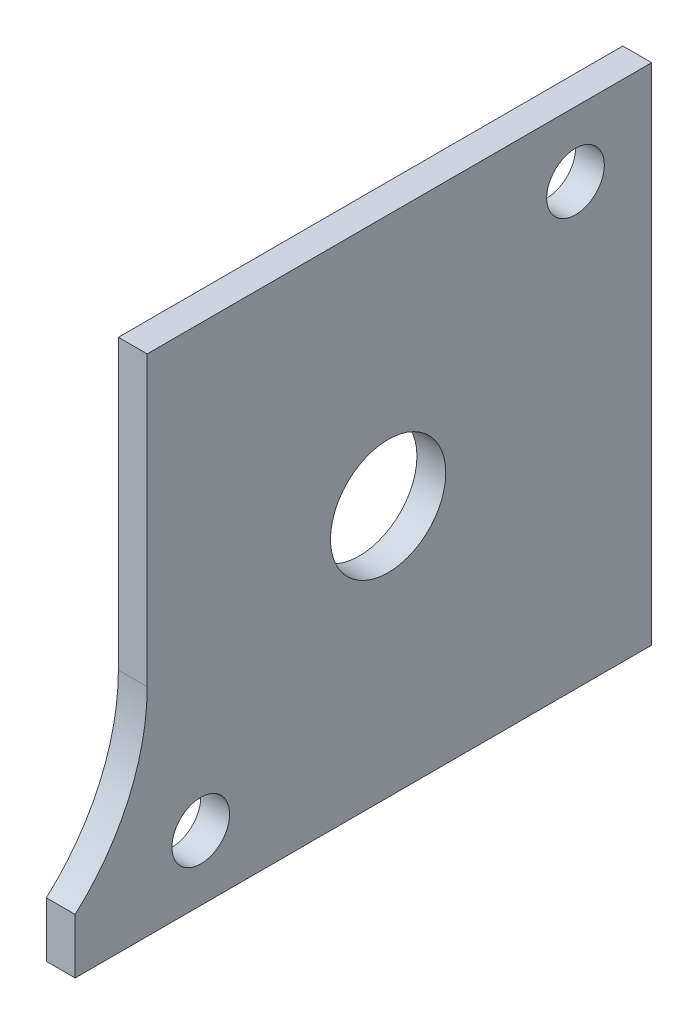
ISO-10303-21;
HEADER;
FILE_DESCRIPTION(('STEP AP214'),'2;1');
FILE_NAME('part.step','',(''),(''),'','','');
FILE_SCHEMA(('AUTOMOTIVE_DESIGN { 1 0 10303 214 1 1 1 1 }'));
ENDSEC;
DATA;
#1=APPLICATION_CONTEXT('core data for automotive mechanical design processes');
#2=APPLICATION_PROTOCOL_DEFINITION('international standard','automotive_design',2000,#1);
#3=PRODUCT_CONTEXT('',#1,'mechanical');
#4=PRODUCT('Part','Part','',(#3));
#5=PRODUCT_RELATED_PRODUCT_CATEGORY('part','',(#4));
#6=PRODUCT_DEFINITION_FORMATION('','',#4);
#7=PRODUCT_DEFINITION_CONTEXT('part definition',#1,'design');
#8=PRODUCT_DEFINITION('design','',#6,#7);
#9=PRODUCT_DEFINITION_SHAPE('','',#8);
#10=(LENGTH_UNIT() NAMED_UNIT(*) SI_UNIT(.MILLI.,.METRE.));
#11=(NAMED_UNIT(*) PLANE_ANGLE_UNIT() SI_UNIT($,.RADIAN.));
#12=(NAMED_UNIT(*) SI_UNIT($,.STERADIAN.) SOLID_ANGLE_UNIT());
#13=UNCERTAINTY_MEASURE_WITH_UNIT(LENGTH_MEASURE(1.E-05),#10,'distance_accuracy_value','');
#14=(GEOMETRIC_REPRESENTATION_CONTEXT(3) GLOBAL_UNCERTAINTY_ASSIGNED_CONTEXT((#13)) GLOBAL_UNIT_ASSIGNED_CONTEXT((#10,
#11,#12)) REPRESENTATION_CONTEXT('',''));
#15=CARTESIAN_POINT('',(0.,0.,0.));
#16=DIRECTION('',(0.,0.,1.));
#17=DIRECTION('',(1.,0.,0.));
#18=AXIS2_PLACEMENT_3D('',#15,#16,#17);
#19=CARTESIAN_POINT('',(2.,-25.9929967703973,-71.2969210397363));
#20=DIRECTION('',(1.,0.,0.));
#21=DIRECTION('',(0.,0.,-1.));
#22=AXIS2_PLACEMENT_3D('',#19,#20,#21);
#23=PLANE('',#22);
#24=CARTESIAN_POINT('',(2.,-36.4929967703972,-90.0114004130906));
#25=DIRECTION('',(1.,0.,0.));
#26=DIRECTION('',(0.,0.,-1.));
#27=AXIS2_PLACEMENT_3D('',#24,#25,#26);
#28=CIRCLE('',#27,2.);
#29=CARTESIAN_POINT('',(2.,-36.4929967703972,-92.0114004130906));
#30=VERTEX_POINT('',#29);
#31=EDGE_CURVE('E182',#30,#30,#28,.T.);
#32=ORIENTED_EDGE('',*,*,#31,.F.);
#33=EDGE_LOOP('',(#32));
#34=FACE_BOUND('',#33,.T.);
#35=DIRECTION('',(0.,0.,1.));
#36=VECTOR('',#35,1.);
#37=CARTESIAN_POINT('',(2.,-5.99299677039726,-121.296921039736));
#38=LINE('',#37,#36);
#39=CARTESIAN_POINT('',(2.,-5.99299677039726,-121.296921039736));
#40=VERTEX_POINT('',#39);
#41=CARTESIAN_POINT('',(2.,-5.99299677039726,-86.2969210397363));
#42=VERTEX_POINT('',#41);
#43=EDGE_CURVE('E126',#40,#42,#38,.T.);
#44=ORIENTED_EDGE('',*,*,#43,.T.);
#45=DIRECTION('',(0.,-1.,0.));
#46=VECTOR('',#45,1.);
#47=CARTESIAN_POINT('',(2.,-25.9929967703973,-86.2969210397363));
#48=LINE('',#47,#46);
#49=CARTESIAN_POINT('',(2.,-25.9929967703973,-86.2969210397363));
#50=VERTEX_POINT('',#49);
#51=EDGE_CURVE('E84',#42,#50,#48,.T.);
#52=ORIENTED_EDGE('',*,*,#51,.T.);
#53=CARTESIAN_POINT('',(2.,-25.9929967703973,-71.2969210397363));
#54=DIRECTION('',(-1.,0.,0.));
#55=DIRECTION('',(0.,0.,-1.));
#56=AXIS2_PLACEMENT_3D('',#53,#54,#55);
#57=CIRCLE('',#56,15.);
#58=CARTESIAN_POINT('',(2.,-37.1733366578962,-81.2969210397363));
#59=VERTEX_POINT('',#58);
#60=EDGE_CURVE('E97',#50,#59,#57,.T.);
#61=ORIENTED_EDGE('',*,*,#60,.T.);
#62=DIRECTION('',(0.,-1.,0.));
#63=VECTOR('',#62,1.);
#64=CARTESIAN_POINT('',(2.,-40.9929967703973,-81.2969210397363));
#65=LINE('',#64,#63);
#66=CARTESIAN_POINT('',(2.,-40.9929967703973,-81.2969210397363));
#67=VERTEX_POINT('',#66);
#68=EDGE_CURVE('E91',#59,#67,#65,.T.);
#69=ORIENTED_EDGE('',*,*,#68,.T.);
#70=DIRECTION('',(0.,0.,-1.));
#71=VECTOR('',#70,1.);
#72=CARTESIAN_POINT('',(2.,-40.9929967703973,-121.296921039736));
#73=LINE('',#72,#71);
#74=CARTESIAN_POINT('',(2.,-40.9929967703973,-121.296921039736));
#75=VERTEX_POINT('',#74);
#76=EDGE_CURVE('E95',#67,#75,#73,.T.);
#77=ORIENTED_EDGE('',*,*,#76,.T.);
#78=DIRECTION('',(0.,1.,0.));
#79=VECTOR('',#78,1.);
#80=CARTESIAN_POINT('',(2.,-40.9929967703973,-121.296921039736));
#81=LINE('',#80,#79);
#82=EDGE_CURVE('E47',#75,#40,#81,.T.);
#83=ORIENTED_EDGE('',*,*,#82,.T.);
#84=EDGE_LOOP('',(#44,#52,#61,#69,#77,#83));
#85=FACE_BOUND('',#84,.T.);
#86=CARTESIAN_POINT('',(2.,-10.4929967703972,-116.011400413091));
#87=DIRECTION('',(1.,0.,0.));
#88=DIRECTION('',(0.,0.,-1.));
#89=AXIS2_PLACEMENT_3D('',#86,#87,#88);
#90=CIRCLE('',#89,2.);
#91=CARTESIAN_POINT('',(2.,-10.4929967703972,-118.011400413091));
#92=VERTEX_POINT('',#91);
#93=EDGE_CURVE('E119',#92,#92,#90,.T.);
#94=ORIENTED_EDGE('',*,*,#93,.F.);
#95=EDGE_LOOP('',(#94));
#96=FACE_BOUND('',#95,.T.);
#97=CARTESIAN_POINT('',(2.,-23.4929967703972,-103.011400413091));
#98=DIRECTION('',(1.,0.,0.));
#99=DIRECTION('',(0.,0.,-1.));
#100=AXIS2_PLACEMENT_3D('',#97,#98,#99);
#101=CIRCLE('',#100,4.00000000000001);
#102=CARTESIAN_POINT('',(2.,-23.4929967703972,-107.011400413091));
#103=VERTEX_POINT('',#102);
#104=EDGE_CURVE('E173',#103,#103,#101,.T.);
#105=ORIENTED_EDGE('',*,*,#104,.F.);
#106=EDGE_LOOP('',(#105));
#107=FACE_BOUND('',#106,.T.);
#108=ADVANCED_FACE('F30',(#34,#85,#96,#107),#23,.T.);
#109=CARTESIAN_POINT('',(0.,-25.9929967703973,-71.2969210397363));
#110=DIRECTION('',(1.,0.,0.));
#111=DIRECTION('',(0.,0.,-1.));
#112=AXIS2_PLACEMENT_3D('',#109,#110,#111);
#113=PLANE('',#112);
#114=CARTESIAN_POINT('',(0.,-36.4929967703972,-90.0114004130906));
#115=DIRECTION('',(1.,0.,0.));
#116=DIRECTION('',(0.,0.,-1.));
#117=AXIS2_PLACEMENT_3D('',#114,#115,#116);
#118=CIRCLE('',#117,2.);
#119=CARTESIAN_POINT('',(0.,-36.4929967703972,-92.0114004130906));
#120=VERTEX_POINT('',#119);
#121=EDGE_CURVE('E179',#120,#120,#118,.T.);
#122=ORIENTED_EDGE('',*,*,#121,.T.);
#123=EDGE_LOOP('',(#122));
#124=FACE_BOUND('',#123,.T.);
#125=DIRECTION('',(0.,0.,1.));
#126=VECTOR('',#125,1.);
#127=CARTESIAN_POINT('',(0.,-5.99299677039726,-121.296921039736));
#128=LINE('',#127,#126);
#129=CARTESIAN_POINT('',(0.,-5.99299677039726,-121.296921039736));
#130=VERTEX_POINT('',#129);
#131=CARTESIAN_POINT('',(0.,-5.99299677039726,-86.2969210397363));
#132=VERTEX_POINT('',#131);
#133=EDGE_CURVE('E115',#130,#132,#128,.T.);
#134=ORIENTED_EDGE('',*,*,#133,.F.);
#135=DIRECTION('',(0.,1.,0.));
#136=VECTOR('',#135,1.);
#137=CARTESIAN_POINT('',(0.,-40.9929967703973,-121.296921039736));
#138=LINE('',#137,#136);
#139=CARTESIAN_POINT('',(0.,-40.9929967703973,-121.296921039736));
#140=VERTEX_POINT('',#139);
#141=EDGE_CURVE('E76',#140,#130,#138,.T.);
#142=ORIENTED_EDGE('',*,*,#141,.F.);
#143=DIRECTION('',(0.,0.,-1.));
#144=VECTOR('',#143,1.);
#145=CARTESIAN_POINT('',(0.,-40.9929967703973,-121.296921039736));
#146=LINE('',#145,#144);
#147=CARTESIAN_POINT('',(0.,-40.9929967703973,-81.2969210397363));
#148=VERTEX_POINT('',#147);
#149=EDGE_CURVE('E70',#148,#140,#146,.T.);
#150=ORIENTED_EDGE('',*,*,#149,.F.);
#151=DIRECTION('',(0.,-1.,0.));
#152=VECTOR('',#151,1.);
#153=CARTESIAN_POINT('',(0.,-40.9929967703973,-81.2969210397363));
#154=LINE('',#153,#152);
#155=CARTESIAN_POINT('',(0.,-37.1733366578962,-81.2969210397363));
#156=VERTEX_POINT('',#155);
#157=EDGE_CURVE('E105',#156,#148,#154,.T.);
#158=ORIENTED_EDGE('',*,*,#157,.F.);
#159=CARTESIAN_POINT('',(0.,-25.9929967703973,-71.2969210397363));
#160=DIRECTION('',(-1.,0.,0.));
#161=DIRECTION('',(0.,0.,-1.));
#162=AXIS2_PLACEMENT_3D('',#159,#160,#161);
#163=CIRCLE('',#162,15.);
#164=CARTESIAN_POINT('',(0.,-25.9929967703973,-86.2969210397363));
#165=VERTEX_POINT('',#164);
#166=EDGE_CURVE('E121',#165,#156,#163,.T.);
#167=ORIENTED_EDGE('',*,*,#166,.F.);
#168=DIRECTION('',(0.,-1.,0.));
#169=VECTOR('',#168,1.);
#170=CARTESIAN_POINT('',(0.,-25.9929967703973,-86.2969210397363));
#171=LINE('',#170,#169);
#172=EDGE_CURVE('E118',#132,#165,#171,.T.);
#173=ORIENTED_EDGE('',*,*,#172,.F.);
#174=EDGE_LOOP('',(#134,#142,#150,#158,#167,#173));
#175=FACE_BOUND('',#174,.T.);
#176=CARTESIAN_POINT('',(0.,-10.4929967703972,-116.011400413091));
#177=DIRECTION('',(1.,0.,0.));
#178=DIRECTION('',(0.,0.,-1.));
#179=AXIS2_PLACEMENT_3D('',#176,#177,#178);
#180=CIRCLE('',#179,2.);
#181=CARTESIAN_POINT('',(0.,-10.4929967703972,-118.011400413091));
#182=VERTEX_POINT('',#181);
#183=EDGE_CURVE('E185',#182,#182,#180,.T.);
#184=ORIENTED_EDGE('',*,*,#183,.T.);
#185=EDGE_LOOP('',(#184));
#186=FACE_BOUND('',#185,.T.);
#187=CARTESIAN_POINT('',(0.,-23.4929967703972,-103.011400413091));
#188=DIRECTION('',(1.,0.,0.));
#189=DIRECTION('',(0.,0.,-1.));
#190=AXIS2_PLACEMENT_3D('',#187,#188,#189);
#191=CIRCLE('',#190,4.00000000000001);
#192=CARTESIAN_POINT('',(0.,-23.4929967703972,-107.011400413091));
#193=VERTEX_POINT('',#192);
#194=EDGE_CURVE('E176',#193,#193,#191,.T.);
#195=ORIENTED_EDGE('',*,*,#194,.T.);
#196=EDGE_LOOP('',(#195));
#197=FACE_BOUND('',#196,.T.);
#198=ADVANCED_FACE('F135',(#124,#175,#186,#197),#113,.F.);
#199=CARTESIAN_POINT('',(2.,-5.99299677039726,-121.296921039736));
#200=DIRECTION('',(0.,-1.,0.));
#201=DIRECTION('',(0.,0.,-1.));
#202=AXIS2_PLACEMENT_3D('',#199,#200,#201);
#203=PLANE('',#202);
#204=ORIENTED_EDGE('',*,*,#133,.T.);
#205=DIRECTION('',(-1.,0.,0.));
#206=VECTOR('',#205,1.);
#207=CARTESIAN_POINT('',(2.,-5.99299677039726,-86.2969210397363));
#208=LINE('',#207,#206);
#209=EDGE_CURVE('E11',#42,#132,#208,.T.);
#210=ORIENTED_EDGE('',*,*,#209,.F.);
#211=ORIENTED_EDGE('',*,*,#43,.F.);
#212=DIRECTION('',(-1.,0.,0.));
#213=VECTOR('',#212,1.);
#214=CARTESIAN_POINT('',(2.,-5.99299677039726,-121.296921039736));
#215=LINE('',#214,#213);
#216=EDGE_CURVE('E111',#40,#130,#215,.T.);
#217=ORIENTED_EDGE('',*,*,#216,.T.);
#218=EDGE_LOOP('',(#204,#210,#211,#217));
#219=FACE_BOUND('',#218,.T.);
#220=ADVANCED_FACE('F32',(#219),#203,.F.);
#221=CARTESIAN_POINT('',(2.,-25.9929967703973,-86.2969210397363));
#222=DIRECTION('',(0.,0.,-1.));
#223=DIRECTION('',(-1.,0.,0.));
#224=AXIS2_PLACEMENT_3D('',#221,#222,#223);
#225=PLANE('',#224);
#226=ORIENTED_EDGE('',*,*,#172,.T.);
#227=DIRECTION('',(-1.,0.,0.));
#228=VECTOR('',#227,1.);
#229=CARTESIAN_POINT('',(2.,-25.9929967703973,-86.2969210397363));
#230=LINE('',#229,#228);
#231=EDGE_CURVE('E39',#50,#165,#230,.T.);
#232=ORIENTED_EDGE('',*,*,#231,.F.);
#233=ORIENTED_EDGE('',*,*,#51,.F.);
#234=ORIENTED_EDGE('',*,*,#209,.T.);
#235=EDGE_LOOP('',(#226,#232,#233,#234));
#236=FACE_BOUND('',#235,.T.);
#237=ADVANCED_FACE('F234',(#236),#225,.F.);
#238=CARTESIAN_POINT('',(2.,-25.9929967703973,-71.2969210397363));
#239=DIRECTION('',(-1.,0.,0.));
#240=DIRECTION('',(0.,0.,1.));
#241=AXIS2_PLACEMENT_3D('',#238,#239,#240);
#242=CYLINDRICAL_SURFACE('',#241,15.);
#243=ORIENTED_EDGE('',*,*,#166,.T.);
#244=DIRECTION('',(-1.,0.,0.));
#245=VECTOR('',#244,1.);
#246=CARTESIAN_POINT('',(2.,-37.1733366578962,-81.2969210397363));
#247=LINE('',#246,#245);
#248=EDGE_CURVE('E106',#59,#156,#247,.T.);
#249=ORIENTED_EDGE('',*,*,#248,.F.);
#250=ORIENTED_EDGE('',*,*,#60,.F.);
#251=ORIENTED_EDGE('',*,*,#231,.T.);
#252=EDGE_LOOP('',(#243,#249,#250,#251));
#253=FACE_BOUND('',#252,.T.);
#254=ADVANCED_FACE('F132',(#253),#242,.F.);
#255=CARTESIAN_POINT('',(2.,-40.9929967703973,-81.2969210397363));
#256=DIRECTION('',(0.,0.,-1.));
#257=DIRECTION('',(-1.,0.,0.));
#258=AXIS2_PLACEMENT_3D('',#255,#256,#257);
#259=PLANE('',#258);
#260=ORIENTED_EDGE('',*,*,#157,.T.);
#261=DIRECTION('',(-1.,0.,0.));
#262=VECTOR('',#261,1.);
#263=CARTESIAN_POINT('',(2.,-40.9929967703973,-81.2969210397363));
#264=LINE('',#263,#262);
#265=EDGE_CURVE('E102',#67,#148,#264,.T.);
#266=ORIENTED_EDGE('',*,*,#265,.F.);
#267=ORIENTED_EDGE('',*,*,#68,.F.);
#268=ORIENTED_EDGE('',*,*,#248,.T.);
#269=EDGE_LOOP('',(#260,#266,#267,#268));
#270=FACE_BOUND('',#269,.T.);
#271=ADVANCED_FACE('F103',(#270),#259,.F.);
#272=CARTESIAN_POINT('',(2.,-40.9929967703973,-121.296921039736));
#273=DIRECTION('',(0.,1.,0.));
#274=DIRECTION('',(0.,0.,1.));
#275=AXIS2_PLACEMENT_3D('',#272,#273,#274);
#276=PLANE('',#275);
#277=ORIENTED_EDGE('',*,*,#149,.T.);
#278=DIRECTION('',(-1.,0.,0.));
#279=VECTOR('',#278,1.);
#280=CARTESIAN_POINT('',(2.,-40.9929967703973,-121.296921039736));
#281=LINE('',#280,#279);
#282=EDGE_CURVE('E107',#75,#140,#281,.T.);
#283=ORIENTED_EDGE('',*,*,#282,.F.);
#284=ORIENTED_EDGE('',*,*,#76,.F.);
#285=ORIENTED_EDGE('',*,*,#265,.T.);
#286=EDGE_LOOP('',(#277,#283,#284,#285));
#287=FACE_BOUND('',#286,.T.);
#288=ADVANCED_FACE('F109',(#287),#276,.F.);
#289=CARTESIAN_POINT('',(2.,-40.9929967703973,-121.296921039736));
#290=DIRECTION('',(0.,0.,1.));
#291=DIRECTION('',(1.,0.,0.));
#292=AXIS2_PLACEMENT_3D('',#289,#290,#291);
#293=PLANE('',#292);
#294=ORIENTED_EDGE('',*,*,#141,.T.);
#295=ORIENTED_EDGE('',*,*,#216,.F.);
#296=ORIENTED_EDGE('',*,*,#82,.F.);
#297=ORIENTED_EDGE('',*,*,#282,.T.);
#298=EDGE_LOOP('',(#294,#295,#296,#297));
#299=FACE_BOUND('',#298,.T.);
#300=ADVANCED_FACE('F140',(#299),#293,.F.);
#301=CARTESIAN_POINT('',(2.,-10.4929967703972,-116.011400413091));
#302=DIRECTION('',(-1.,0.,0.));
#303=DIRECTION('',(0.,0.,1.));
#304=AXIS2_PLACEMENT_3D('',#301,#302,#303);
#305=CYLINDRICAL_SURFACE('',#304,2.);
#306=ORIENTED_EDGE('',*,*,#93,.T.);
#307=EDGE_LOOP('',(#306));
#308=FACE_BOUND('',#307,.T.);
#309=ORIENTED_EDGE('',*,*,#183,.F.);
#310=EDGE_LOOP('',(#309));
#311=FACE_BOUND('',#310,.T.);
#312=ADVANCED_FACE('F142',(#308,#311),#305,.F.);
#313=CARTESIAN_POINT('',(2.,-36.4929967703972,-90.0114004130906));
#314=DIRECTION('',(-1.,0.,0.));
#315=DIRECTION('',(0.,0.,1.));
#316=AXIS2_PLACEMENT_3D('',#313,#314,#315);
#317=CYLINDRICAL_SURFACE('',#316,2.);
#318=ORIENTED_EDGE('',*,*,#31,.T.);
#319=EDGE_LOOP('',(#318));
#320=FACE_BOUND('',#319,.T.);
#321=ORIENTED_EDGE('',*,*,#121,.F.);
#322=EDGE_LOOP('',(#321));
#323=FACE_BOUND('',#322,.T.);
#324=ADVANCED_FACE('F148',(#320,#323),#317,.F.);
#325=CARTESIAN_POINT('',(2.,-23.4929967703972,-103.011400413091));
#326=DIRECTION('',(-1.,0.,0.));
#327=DIRECTION('',(0.,0.,1.));
#328=AXIS2_PLACEMENT_3D('',#325,#326,#327);
#329=CYLINDRICAL_SURFACE('',#328,4.00000000000001);
#330=ORIENTED_EDGE('',*,*,#104,.T.);
#331=EDGE_LOOP('',(#330));
#332=FACE_BOUND('',#331,.T.);
#333=ORIENTED_EDGE('',*,*,#194,.F.);
#334=EDGE_LOOP('',(#333));
#335=FACE_BOUND('',#334,.T.);
#336=ADVANCED_FACE('F164',(#332,#335),#329,.F.);
#337=CLOSED_SHELL('',(#108,#198,#220,#237,#254,#271,#288,#300,#312,#324,#336));
#338=MANIFOLD_SOLID_BREP('B2',#337);
#339=ADVANCED_BREP_SHAPE_REPRESENTATION('',(#18,#338),#14);
#340=SHAPE_DEFINITION_REPRESENTATION(#9,#339);
ENDSEC;
END-ISO-10303-21;
